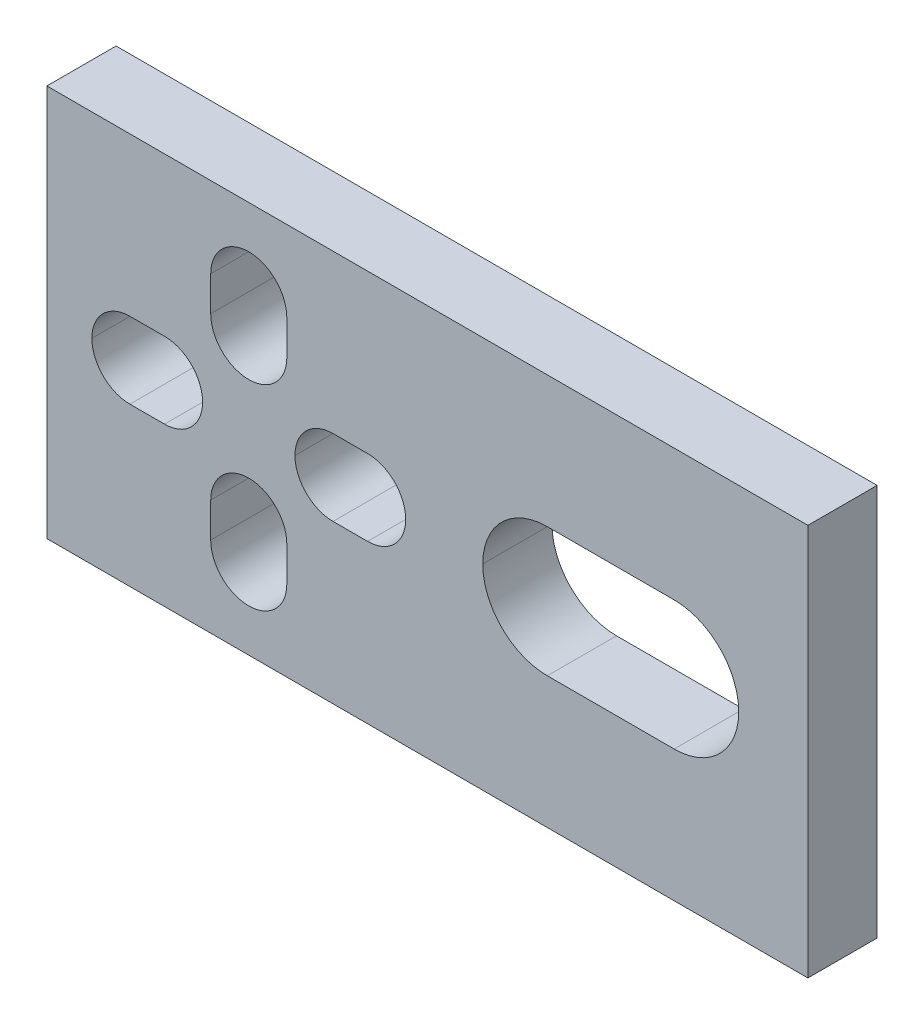
ISO-10303-21;
HEADER;
FILE_DESCRIPTION(('STEP AP214'),'2;1');
FILE_NAME('part.step','',(''),(''),'','','');
FILE_SCHEMA(('AUTOMOTIVE_DESIGN { 1 0 10303 214 1 1 1 1 }'));
ENDSEC;
DATA;
#1=APPLICATION_CONTEXT('core data for automotive mechanical design processes');
#2=APPLICATION_PROTOCOL_DEFINITION('international standard','automotive_design',2000,#1);
#3=PRODUCT_CONTEXT('',#1,'mechanical');
#4=PRODUCT('Part','Part','',(#3));
#5=PRODUCT_RELATED_PRODUCT_CATEGORY('part','',(#4));
#6=PRODUCT_DEFINITION_FORMATION('','',#4);
#7=PRODUCT_DEFINITION_CONTEXT('part definition',#1,'design');
#8=PRODUCT_DEFINITION('design','',#6,#7);
#9=PRODUCT_DEFINITION_SHAPE('','',#8);
#10=(LENGTH_UNIT() NAMED_UNIT(*) SI_UNIT(.MILLI.,.METRE.));
#11=(NAMED_UNIT(*) PLANE_ANGLE_UNIT() SI_UNIT($,.RADIAN.));
#12=(NAMED_UNIT(*) SI_UNIT($,.STERADIAN.) SOLID_ANGLE_UNIT());
#13=UNCERTAINTY_MEASURE_WITH_UNIT(LENGTH_MEASURE(1.E-05),#10,'distance_accuracy_value','');
#14=(GEOMETRIC_REPRESENTATION_CONTEXT(3) GLOBAL_UNCERTAINTY_ASSIGNED_CONTEXT((#13)) GLOBAL_UNIT_ASSIGNED_CONTEXT((#10,
#11,#12)) REPRESENTATION_CONTEXT('',''));
#15=CARTESIAN_POINT('',(0.,0.,0.));
#16=DIRECTION('',(0.,0.,1.));
#17=DIRECTION('',(1.,0.,0.));
#18=AXIS2_PLACEMENT_3D('',#15,#16,#17);
#19=CARTESIAN_POINT('',(-2.59330659401342,-1.65,3.));
#20=DIRECTION('',(0.,1.,0.));
#21=DIRECTION('',(1.,0.,0.));
#22=AXIS2_PLACEMENT_3D('',#19,#20,#21);
#23=PLANE('',#22);
#24=DIRECTION('',(-1.,0.,0.));
#25=VECTOR('',#24,1.);
#26=CARTESIAN_POINT('',(0.,-1.65,3.));
#27=LINE('',#26,#25);
#28=CARTESIAN_POINT('',(-2.59330659401342,-1.65,3.));
#29=VERTEX_POINT('',#28);
#30=CARTESIAN_POINT('',(-4.09330659401341,-1.65,3.));
#31=VERTEX_POINT('',#30);
#32=EDGE_CURVE('E11',#29,#31,#27,.T.);
#33=ORIENTED_EDGE('',*,*,#32,.F.);
#34=DIRECTION('',(0.,0.,-1.));
#35=VECTOR('',#34,1.);
#36=CARTESIAN_POINT('',(-2.59330659401342,-1.65,3.));
#37=LINE('',#36,#35);
#38=CARTESIAN_POINT('',(-2.59330659401342,-1.65,0.));
#39=VERTEX_POINT('',#38);
#40=EDGE_CURVE('E440',#29,#39,#37,.T.);
#41=ORIENTED_EDGE('',*,*,#40,.T.);
#42=DIRECTION('',(-1.,0.,0.));
#43=VECTOR('',#42,1.);
#44=CARTESIAN_POINT('',(-2.59330659401342,-1.65,0.));
#45=LINE('',#44,#43);
#46=CARTESIAN_POINT('',(-4.09330659401341,-1.65,0.));
#47=VERTEX_POINT('',#46);
#48=EDGE_CURVE('E347',#39,#47,#45,.T.);
#49=ORIENTED_EDGE('',*,*,#48,.T.);
#50=DIRECTION('',(0.,0.,1.));
#51=VECTOR('',#50,1.);
#52=CARTESIAN_POINT('',(-4.09330659401341,-1.65,3.));
#53=LINE('',#52,#51);
#54=EDGE_CURVE('E437',#47,#31,#53,.T.);
#55=ORIENTED_EDGE('',*,*,#54,.T.);
#56=EDGE_LOOP('',(#33,#41,#49,#55));
#57=FACE_BOUND('',#56,.T.);
#58=ADVANCED_FACE('F18',(#57),#23,.T.);
#59=CARTESIAN_POINT('',(-2.59330659401342,1.65,3.));
#60=DIRECTION('',(0.,-1.,0.));
#61=DIRECTION('',(0.,0.,-1.));
#62=AXIS2_PLACEMENT_3D('',#59,#60,#61);
#63=PLANE('',#62);
#64=DIRECTION('',(1.,0.,0.));
#65=VECTOR('',#64,1.);
#66=CARTESIAN_POINT('',(0.,1.65,3.));
#67=LINE('',#66,#65);
#68=CARTESIAN_POINT('',(-4.09330659401341,1.65,3.));
#69=VERTEX_POINT('',#68);
#70=CARTESIAN_POINT('',(-2.59330659401342,1.65,3.));
#71=VERTEX_POINT('',#70);
#72=EDGE_CURVE('E26',#69,#71,#67,.T.);
#73=ORIENTED_EDGE('',*,*,#72,.F.);
#74=DIRECTION('',(0.,0.,-1.));
#75=VECTOR('',#74,1.);
#76=CARTESIAN_POINT('',(-4.09330659401341,1.65,3.));
#77=LINE('',#76,#75);
#78=CARTESIAN_POINT('',(-4.09330659401341,1.65,0.));
#79=VERTEX_POINT('',#78);
#80=EDGE_CURVE('E822',#69,#79,#77,.T.);
#81=ORIENTED_EDGE('',*,*,#80,.T.);
#82=DIRECTION('',(1.,0.,0.));
#83=VECTOR('',#82,1.);
#84=CARTESIAN_POINT('',(-2.59330659401342,1.65,0.));
#85=LINE('',#84,#83);
#86=CARTESIAN_POINT('',(-2.59330659401342,1.65,0.));
#87=VERTEX_POINT('',#86);
#88=EDGE_CURVE('E361',#79,#87,#85,.T.);
#89=ORIENTED_EDGE('',*,*,#88,.T.);
#90=DIRECTION('',(0.,0.,1.));
#91=VECTOR('',#90,1.);
#92=CARTESIAN_POINT('',(-2.59330659401342,1.65,3.));
#93=LINE('',#92,#91);
#94=EDGE_CURVE('E446',#87,#71,#93,.T.);
#95=ORIENTED_EDGE('',*,*,#94,.T.);
#96=EDGE_LOOP('',(#73,#81,#89,#95));
#97=FACE_BOUND('',#96,.T.);
#98=ADVANCED_FACE('F1005',(#97),#63,.T.);
#99=CARTESIAN_POINT('',(-6.09665329700671,-3.5,3.));
#100=DIRECTION('',(-1.,0.,0.));
#101=DIRECTION('',(0.,0.,1.));
#102=AXIS2_PLACEMENT_3D('',#99,#100,#101);
#103=PLANE('',#102);
#104=DIRECTION('',(0.,-1.,0.));
#105=VECTOR('',#104,1.);
#106=CARTESIAN_POINT('',(-6.09665329700671,0.,3.));
#107=LINE('',#106,#105);
#108=CARTESIAN_POINT('',(-6.09665329700671,-3.5,3.));
#109=VERTEX_POINT('',#108);
#110=CARTESIAN_POINT('',(-6.09665329700671,-5.,3.));
#111=VERTEX_POINT('',#110);
#112=EDGE_CURVE('E249',#109,#111,#107,.T.);
#113=ORIENTED_EDGE('',*,*,#112,.F.);
#114=DIRECTION('',(0.,0.,-1.));
#115=VECTOR('',#114,1.);
#116=CARTESIAN_POINT('',(-6.09665329700671,-3.5,3.));
#117=LINE('',#116,#115);
#118=CARTESIAN_POINT('',(-6.09665329700671,-3.5,0.));
#119=VERTEX_POINT('',#118);
#120=EDGE_CURVE('E254',#109,#119,#117,.T.);
#121=ORIENTED_EDGE('',*,*,#120,.T.);
#122=DIRECTION('',(0.,-1.,0.));
#123=VECTOR('',#122,1.);
#124=CARTESIAN_POINT('',(-6.09665329700671,-3.5,0.));
#125=LINE('',#124,#123);
#126=CARTESIAN_POINT('',(-6.09665329700671,-5.,0.));
#127=VERTEX_POINT('',#126);
#128=EDGE_CURVE('E317',#119,#127,#125,.T.);
#129=ORIENTED_EDGE('',*,*,#128,.T.);
#130=DIRECTION('',(0.,0.,1.));
#131=VECTOR('',#130,1.);
#132=CARTESIAN_POINT('',(-6.09665329700671,-5.,3.));
#133=LINE('',#132,#131);
#134=EDGE_CURVE('E256',#127,#111,#133,.T.);
#135=ORIENTED_EDGE('',*,*,#134,.T.);
#136=EDGE_LOOP('',(#113,#121,#129,#135));
#137=FACE_BOUND('',#136,.T.);
#138=ADVANCED_FACE('F251',(#137),#103,.T.);
#139=CARTESIAN_POINT('',(-9.39665329700671,-5.,3.));
#140=DIRECTION('',(1.,0.,0.));
#141=DIRECTION('',(0.,1.,0.));
#142=AXIS2_PLACEMENT_3D('',#139,#140,#141);
#143=PLANE('',#142);
#144=DIRECTION('',(0.,1.,0.));
#145=VECTOR('',#144,1.);
#146=CARTESIAN_POINT('',(-9.39665329700671,0.,3.));
#147=LINE('',#146,#145);
#148=CARTESIAN_POINT('',(-9.39665329700671,-5.,3.));
#149=VERTEX_POINT('',#148);
#150=CARTESIAN_POINT('',(-9.39665329700671,-3.5,3.));
#151=VERTEX_POINT('',#150);
#152=EDGE_CURVE('E261',#149,#151,#147,.T.);
#153=ORIENTED_EDGE('',*,*,#152,.F.);
#154=DIRECTION('',(0.,0.,-1.));
#155=VECTOR('',#154,1.);
#156=CARTESIAN_POINT('',(-9.39665329700671,-5.,3.));
#157=LINE('',#156,#155);
#158=CARTESIAN_POINT('',(-9.39665329700671,-5.,0.));
#159=VERTEX_POINT('',#158);
#160=EDGE_CURVE('E365',#149,#159,#157,.T.);
#161=ORIENTED_EDGE('',*,*,#160,.T.);
#162=DIRECTION('',(0.,1.,0.));
#163=VECTOR('',#162,1.);
#164=CARTESIAN_POINT('',(-9.39665329700671,-5.,0.));
#165=LINE('',#164,#163);
#166=CARTESIAN_POINT('',(-9.39665329700671,-3.5,0.));
#167=VERTEX_POINT('',#166);
#168=EDGE_CURVE('E339',#159,#167,#165,.T.);
#169=ORIENTED_EDGE('',*,*,#168,.T.);
#170=DIRECTION('',(0.,0.,1.));
#171=VECTOR('',#170,1.);
#172=CARTESIAN_POINT('',(-9.39665329700671,-3.5,3.));
#173=LINE('',#172,#171);
#174=EDGE_CURVE('E269',#167,#151,#173,.T.);
#175=ORIENTED_EDGE('',*,*,#174,.T.);
#176=EDGE_LOOP('',(#153,#161,#169,#175));
#177=FACE_BOUND('',#176,.T.);
#178=ADVANCED_FACE('F1015',(#177),#143,.T.);
#179=CARTESIAN_POINT('',(-12.9,-1.65,3.));
#180=DIRECTION('',(0.,1.,0.));
#181=DIRECTION('',(1.,0.,0.));
#182=AXIS2_PLACEMENT_3D('',#179,#180,#181);
#183=PLANE('',#182);
#184=DIRECTION('',(-1.,0.,0.));
#185=VECTOR('',#184,1.);
#186=CARTESIAN_POINT('',(0.,-1.65,3.));
#187=LINE('',#186,#185);
#188=CARTESIAN_POINT('',(-11.4,-1.65,3.));
#189=VERTEX_POINT('',#188);
#190=CARTESIAN_POINT('',(-12.9,-1.65,3.));
#191=VERTEX_POINT('',#190);
#192=EDGE_CURVE('E451',#189,#191,#187,.T.);
#193=ORIENTED_EDGE('',*,*,#192,.F.);
#194=DIRECTION('',(0.,0.,-1.));
#195=VECTOR('',#194,1.);
#196=CARTESIAN_POINT('',(-11.4,-1.65,3.));
#197=LINE('',#196,#195);
#198=CARTESIAN_POINT('',(-11.4,-1.65,0.));
#199=VERTEX_POINT('',#198);
#200=EDGE_CURVE('E407',#189,#199,#197,.T.);
#201=ORIENTED_EDGE('',*,*,#200,.T.);
#202=DIRECTION('',(-1.,0.,0.));
#203=VECTOR('',#202,1.);
#204=CARTESIAN_POINT('',(-12.9,-1.65,0.));
#205=LINE('',#204,#203);
#206=CARTESIAN_POINT('',(-12.9,-1.65,0.));
#207=VERTEX_POINT('',#206);
#208=EDGE_CURVE('E316',#199,#207,#205,.T.);
#209=ORIENTED_EDGE('',*,*,#208,.T.);
#210=DIRECTION('',(0.,0.,1.));
#211=VECTOR('',#210,1.);
#212=CARTESIAN_POINT('',(-12.9,-1.65,3.));
#213=LINE('',#212,#211);
#214=EDGE_CURVE('E406',#207,#191,#213,.T.);
#215=ORIENTED_EDGE('',*,*,#214,.T.);
#216=EDGE_LOOP('',(#193,#201,#209,#215));
#217=FACE_BOUND('',#216,.T.);
#218=ADVANCED_FACE('F1020',(#217),#183,.T.);
#219=CARTESIAN_POINT('',(-12.9,1.65,3.));
#220=DIRECTION('',(0.,-1.,0.));
#221=DIRECTION('',(0.,0.,-1.));
#222=AXIS2_PLACEMENT_3D('',#219,#220,#221);
#223=PLANE('',#222);
#224=DIRECTION('',(1.,0.,0.));
#225=VECTOR('',#224,1.);
#226=CARTESIAN_POINT('',(0.,1.65,3.));
#227=LINE('',#226,#225);
#228=CARTESIAN_POINT('',(-12.9,1.65,3.));
#229=VERTEX_POINT('',#228);
#230=CARTESIAN_POINT('',(-11.4,1.65,3.));
#231=VERTEX_POINT('',#230);
#232=EDGE_CURVE('E454',#229,#231,#227,.T.);
#233=ORIENTED_EDGE('',*,*,#232,.F.);
#234=DIRECTION('',(0.,0.,-1.));
#235=VECTOR('',#234,1.);
#236=CARTESIAN_POINT('',(-12.9,1.65,3.));
#237=LINE('',#236,#235);
#238=CARTESIAN_POINT('',(-12.9,1.65,0.));
#239=VERTEX_POINT('',#238);
#240=EDGE_CURVE('E813',#229,#239,#237,.T.);
#241=ORIENTED_EDGE('',*,*,#240,.T.);
#242=DIRECTION('',(1.,0.,0.));
#243=VECTOR('',#242,1.);
#244=CARTESIAN_POINT('',(-12.9,1.65,0.));
#245=LINE('',#244,#243);
#246=CARTESIAN_POINT('',(-11.4,1.65,0.));
#247=VERTEX_POINT('',#246);
#248=EDGE_CURVE('E320',#239,#247,#245,.T.);
#249=ORIENTED_EDGE('',*,*,#248,.T.);
#250=DIRECTION('',(0.,0.,1.));
#251=VECTOR('',#250,1.);
#252=CARTESIAN_POINT('',(-11.4,1.65,3.));
#253=LINE('',#252,#251);
#254=EDGE_CURVE('E348',#247,#231,#253,.T.);
#255=ORIENTED_EDGE('',*,*,#254,.T.);
#256=EDGE_LOOP('',(#233,#241,#249,#255));
#257=FACE_BOUND('',#256,.T.);
#258=ADVANCED_FACE('F1022',(#257),#223,.T.);
#259=CARTESIAN_POINT('',(-6.09665329700671,3.5,3.));
#260=DIRECTION('',(-1.,0.,0.));
#261=DIRECTION('',(0.,0.,1.));
#262=AXIS2_PLACEMENT_3D('',#259,#260,#261);
#263=PLANE('',#262);
#264=DIRECTION('',(0.,-1.,0.));
#265=VECTOR('',#264,1.);
#266=CARTESIAN_POINT('',(-6.09665329700671,0.,3.));
#267=LINE('',#266,#265);
#268=CARTESIAN_POINT('',(-6.09665329700671,5.,3.));
#269=VERTEX_POINT('',#268);
#270=CARTESIAN_POINT('',(-6.09665329700671,3.5,3.));
#271=VERTEX_POINT('',#270);
#272=EDGE_CURVE('E450',#269,#271,#267,.T.);
#273=ORIENTED_EDGE('',*,*,#272,.F.);
#274=DIRECTION('',(0.,0.,-1.));
#275=VECTOR('',#274,1.);
#276=CARTESIAN_POINT('',(-6.09665329700671,5.,3.));
#277=LINE('',#276,#275);
#278=CARTESIAN_POINT('',(-6.09665329700671,5.,0.));
#279=VERTEX_POINT('',#278);
#280=EDGE_CURVE('E398',#269,#279,#277,.T.);
#281=ORIENTED_EDGE('',*,*,#280,.T.);
#282=DIRECTION('',(0.,-1.,0.));
#283=VECTOR('',#282,1.);
#284=CARTESIAN_POINT('',(-6.09665329700671,3.5,0.));
#285=LINE('',#284,#283);
#286=CARTESIAN_POINT('',(-6.09665329700671,3.5,0.));
#287=VERTEX_POINT('',#286);
#288=EDGE_CURVE('E291',#279,#287,#285,.T.);
#289=ORIENTED_EDGE('',*,*,#288,.T.);
#290=DIRECTION('',(0.,0.,1.));
#291=VECTOR('',#290,1.);
#292=CARTESIAN_POINT('',(-6.09665329700671,3.5,3.));
#293=LINE('',#292,#291);
#294=EDGE_CURVE('E397',#287,#271,#293,.T.);
#295=ORIENTED_EDGE('',*,*,#294,.T.);
#296=EDGE_LOOP('',(#273,#281,#289,#295));
#297=FACE_BOUND('',#296,.T.);
#298=ADVANCED_FACE('F1025',(#297),#263,.T.);
#299=CARTESIAN_POINT('',(-9.39665329700671,5.,3.));
#300=DIRECTION('',(1.,0.,0.));
#301=DIRECTION('',(0.,1.,0.));
#302=AXIS2_PLACEMENT_3D('',#299,#300,#301);
#303=PLANE('',#302);
#304=DIRECTION('',(0.,1.,0.));
#305=VECTOR('',#304,1.);
#306=CARTESIAN_POINT('',(-9.39665329700671,0.,3.));
#307=LINE('',#306,#305);
#308=CARTESIAN_POINT('',(-9.39665329700671,3.5,3.));
#309=VERTEX_POINT('',#308);
#310=CARTESIAN_POINT('',(-9.39665329700671,5.,3.));
#311=VERTEX_POINT('',#310);
#312=EDGE_CURVE('E447',#309,#311,#307,.T.);
#313=ORIENTED_EDGE('',*,*,#312,.F.);
#314=DIRECTION('',(0.,0.,-1.));
#315=VECTOR('',#314,1.);
#316=CARTESIAN_POINT('',(-9.39665329700671,3.5,3.));
#317=LINE('',#316,#315);
#318=CARTESIAN_POINT('',(-9.39665329700671,3.5,0.));
#319=VERTEX_POINT('',#318);
#320=EDGE_CURVE('E390',#309,#319,#317,.T.);
#321=ORIENTED_EDGE('',*,*,#320,.T.);
#322=DIRECTION('',(0.,1.,0.));
#323=VECTOR('',#322,1.);
#324=CARTESIAN_POINT('',(-9.39665329700671,5.,0.));
#325=LINE('',#324,#323);
#326=CARTESIAN_POINT('',(-9.39665329700671,5.,0.));
#327=VERTEX_POINT('',#326);
#328=EDGE_CURVE('E299',#319,#327,#325,.T.);
#329=ORIENTED_EDGE('',*,*,#328,.T.);
#330=DIRECTION('',(0.,0.,1.));
#331=VECTOR('',#330,1.);
#332=CARTESIAN_POINT('',(-9.39665329700671,5.,3.));
#333=LINE('',#332,#331);
#334=EDGE_CURVE('E300',#327,#311,#333,.T.);
#335=ORIENTED_EDGE('',*,*,#334,.T.);
#336=EDGE_LOOP('',(#313,#321,#329,#335));
#337=FACE_BOUND('',#336,.T.);
#338=ADVANCED_FACE('F1027',(#337),#303,.T.);
#339=CARTESIAN_POINT('',(0.,0.,3.));
#340=DIRECTION('',(0.,0.,1.));
#341=DIRECTION('',(1.,0.,0.));
#342=AXIS2_PLACEMENT_3D('',#339,#340,#341);
#343=PLANE('',#342);
#344=ORIENTED_EDGE('',*,*,#72,.T.);
#345=CARTESIAN_POINT('',(-2.59330659401342,0.,3.));
#346=DIRECTION('',(0.,0.,-1.));
#347=DIRECTION('',(-1.,0.,0.));
#348=AXIS2_PLACEMENT_3D('',#345,#346,#347);
#349=CIRCLE('',#348,1.65);
#350=EDGE_CURVE('E443',#71,#29,#349,.T.);
#351=ORIENTED_EDGE('',*,*,#350,.T.);
#352=ORIENTED_EDGE('',*,*,#32,.T.);
#353=CARTESIAN_POINT('',(-4.09330659401341,0.,3.));
#354=DIRECTION('',(0.,0.,-1.));
#355=DIRECTION('',(-1.,0.,0.));
#356=AXIS2_PLACEMENT_3D('',#353,#354,#355);
#357=CIRCLE('',#356,1.65);
#358=CARTESIAN_POINT('',(-5.74330659401342,0.,3.));
#359=VERTEX_POINT('',#358);
#360=EDGE_CURVE('E434',#31,#359,#357,.T.);
#361=ORIENTED_EDGE('',*,*,#360,.T.);
#362=CARTESIAN_POINT('',(-4.09330659401341,0.,3.));
#363=DIRECTION('',(0.,0.,-1.));
#364=DIRECTION('',(-1.,0.,0.));
#365=AXIS2_PLACEMENT_3D('',#362,#363,#364);
#366=CIRCLE('',#365,1.65);
#367=EDGE_CURVE('E804',#359,#69,#366,.T.);
#368=ORIENTED_EDGE('',*,*,#367,.T.);
#369=EDGE_LOOP('',(#344,#351,#352,#361,#368));
#370=FACE_BOUND('',#369,.T.);
#371=ORIENTED_EDGE('',*,*,#152,.T.);
#372=CARTESIAN_POINT('',(-7.74665329700671,-3.5,3.));
#373=DIRECTION('',(0.,0.,-1.));
#374=DIRECTION('',(-1.,0.,0.));
#375=AXIS2_PLACEMENT_3D('',#372,#373,#374);
#376=CIRCLE('',#375,1.65);
#377=EDGE_CURVE('E263',#151,#109,#376,.T.);
#378=ORIENTED_EDGE('',*,*,#377,.T.);
#379=ORIENTED_EDGE('',*,*,#112,.T.);
#380=CARTESIAN_POINT('',(-7.74665329700671,-5.,3.));
#381=DIRECTION('',(0.,0.,-1.));
#382=DIRECTION('',(-1.,0.,0.));
#383=AXIS2_PLACEMENT_3D('',#380,#381,#382);
#384=CIRCLE('',#383,1.65);
#385=EDGE_CURVE('E281',#111,#149,#384,.T.);
#386=ORIENTED_EDGE('',*,*,#385,.T.);
#387=EDGE_LOOP('',(#371,#378,#379,#386));
#388=FACE_BOUND('',#387,.T.);
#389=ORIENTED_EDGE('',*,*,#232,.T.);
#390=CARTESIAN_POINT('',(-11.4,0.,3.));
#391=DIRECTION('',(0.,0.,-1.));
#392=DIRECTION('',(-1.,0.,0.));
#393=AXIS2_PLACEMENT_3D('',#390,#391,#392);
#394=CIRCLE('',#393,1.65);
#395=EDGE_CURVE('E353',#231,#189,#394,.T.);
#396=ORIENTED_EDGE('',*,*,#395,.T.);
#397=ORIENTED_EDGE('',*,*,#192,.T.);
#398=CARTESIAN_POINT('',(-12.9,0.,3.));
#399=DIRECTION('',(0.,0.,-1.));
#400=DIRECTION('',(-1.,0.,0.));
#401=AXIS2_PLACEMENT_3D('',#398,#399,#400);
#402=CIRCLE('',#401,1.65);
#403=CARTESIAN_POINT('',(-14.55,0.,3.));
#404=VERTEX_POINT('',#403);
#405=EDGE_CURVE('E304',#191,#404,#402,.T.);
#406=ORIENTED_EDGE('',*,*,#405,.T.);
#407=CARTESIAN_POINT('',(-12.9,0.,3.));
#408=DIRECTION('',(0.,0.,-1.));
#409=DIRECTION('',(-1.,0.,0.));
#410=AXIS2_PLACEMENT_3D('',#407,#408,#409);
#411=CIRCLE('',#410,1.65);
#412=EDGE_CURVE('E858',#404,#229,#411,.T.);
#413=ORIENTED_EDGE('',*,*,#412,.T.);
#414=EDGE_LOOP('',(#389,#396,#397,#406,#413));
#415=FACE_BOUND('',#414,.T.);
#416=ORIENTED_EDGE('',*,*,#312,.T.);
#417=CARTESIAN_POINT('',(-7.74665329700671,5.,3.));
#418=DIRECTION('',(0.,0.,-1.));
#419=DIRECTION('',(-1.,0.,0.));
#420=AXIS2_PLACEMENT_3D('',#417,#418,#419);
#421=CIRCLE('',#420,1.65);
#422=EDGE_CURVE('E305',#311,#269,#421,.T.);
#423=ORIENTED_EDGE('',*,*,#422,.T.);
#424=ORIENTED_EDGE('',*,*,#272,.T.);
#425=CARTESIAN_POINT('',(-7.74665329700671,3.5,3.));
#426=DIRECTION('',(0.,0.,-1.));
#427=DIRECTION('',(-1.,0.,0.));
#428=AXIS2_PLACEMENT_3D('',#425,#426,#427);
#429=CIRCLE('',#428,1.65);
#430=EDGE_CURVE('E393',#271,#309,#429,.T.);
#431=ORIENTED_EDGE('',*,*,#430,.T.);
#432=EDGE_LOOP('',(#416,#423,#424,#431));
#433=FACE_BOUND('',#432,.T.);
#434=DIRECTION('',(-1.,0.,0.));
#435=VECTOR('',#434,1.);
#436=CARTESIAN_POINT('',(5.2,2.8,3.));
#437=LINE('',#436,#435);
#438=CARTESIAN_POINT('',(10.7,2.8,3.));
#439=VERTEX_POINT('',#438);
#440=CARTESIAN_POINT('',(5.2,2.8,3.));
#441=VERTEX_POINT('',#440);
#442=EDGE_CURVE('E332',#439,#441,#437,.T.);
#443=ORIENTED_EDGE('',*,*,#442,.F.);
#444=CARTESIAN_POINT('',(10.7,0.,3.));
#445=DIRECTION('',(0.,0.,-1.));
#446=DIRECTION('',(-1.,0.,0.));
#447=AXIS2_PLACEMENT_3D('',#444,#445,#446);
#448=CIRCLE('',#447,2.8);
#449=CARTESIAN_POINT('',(10.7,-2.8,3.));
#450=VERTEX_POINT('',#449);
#451=EDGE_CURVE('E333',#439,#450,#448,.T.);
#452=ORIENTED_EDGE('',*,*,#451,.T.);
#453=DIRECTION('',(1.,0.,0.));
#454=VECTOR('',#453,1.);
#455=CARTESIAN_POINT('',(5.2,-2.8,3.));
#456=LINE('',#455,#454);
#457=CARTESIAN_POINT('',(5.2,-2.8,3.));
#458=VERTEX_POINT('',#457);
#459=EDGE_CURVE('E379',#458,#450,#456,.T.);
#460=ORIENTED_EDGE('',*,*,#459,.F.);
#461=CARTESIAN_POINT('',(5.2,0.,3.));
#462=DIRECTION('',(0.,0.,-1.));
#463=DIRECTION('',(-1.,0.,0.));
#464=AXIS2_PLACEMENT_3D('',#461,#462,#463);
#465=CIRCLE('',#464,2.8);
#466=CARTESIAN_POINT('',(2.4,0.,3.));
#467=VERTEX_POINT('',#466);
#468=EDGE_CURVE('E374',#458,#467,#465,.T.);
#469=ORIENTED_EDGE('',*,*,#468,.T.);
#470=CARTESIAN_POINT('',(5.2,0.,3.));
#471=DIRECTION('',(0.,0.,-1.));
#472=DIRECTION('',(-1.,0.,0.));
#473=AXIS2_PLACEMENT_3D('',#470,#471,#472);
#474=CIRCLE('',#473,2.8);
#475=EDGE_CURVE('E888',#467,#441,#474,.T.);
#476=ORIENTED_EDGE('',*,*,#475,.T.);
#477=EDGE_LOOP('',(#443,#452,#460,#469,#476));
#478=FACE_BOUND('',#477,.T.);
#479=DIRECTION('',(0.,-1.,0.));
#480=VECTOR('',#479,1.);
#481=CARTESIAN_POINT('',(-16.5,8.5,3.));
#482=LINE('',#481,#480);
#483=CARTESIAN_POINT('',(-16.5,8.5,3.));
#484=VERTEX_POINT('',#483);
#485=CARTESIAN_POINT('',(-16.5,-8.5,3.));
#486=VERTEX_POINT('',#485);
#487=EDGE_CURVE('E427',#484,#486,#482,.T.);
#488=ORIENTED_EDGE('',*,*,#487,.T.);
#489=DIRECTION('',(1.,0.,0.));
#490=VECTOR('',#489,1.);
#491=CARTESIAN_POINT('',(-16.5,-8.5,3.));
#492=LINE('',#491,#490);
#493=CARTESIAN_POINT('',(16.5,-8.5,3.));
#494=VERTEX_POINT('',#493);
#495=EDGE_CURVE('E420',#486,#494,#492,.T.);
#496=ORIENTED_EDGE('',*,*,#495,.T.);
#497=DIRECTION('',(0.,1.,0.));
#498=VECTOR('',#497,1.);
#499=CARTESIAN_POINT('',(16.5,8.5,3.));
#500=LINE('',#499,#498);
#501=CARTESIAN_POINT('',(16.5,8.5,3.));
#502=VERTEX_POINT('',#501);
#503=EDGE_CURVE('E370',#494,#502,#500,.T.);
#504=ORIENTED_EDGE('',*,*,#503,.T.);
#505=DIRECTION('',(-1.,0.,0.));
#506=VECTOR('',#505,1.);
#507=CARTESIAN_POINT('',(-16.5,8.5,3.));
#508=LINE('',#507,#506);
#509=EDGE_CURVE('E362',#502,#484,#508,.T.);
#510=ORIENTED_EDGE('',*,*,#509,.T.);
#511=EDGE_LOOP('',(#488,#496,#504,#510));
#512=FACE_BOUND('',#511,.T.);
#513=ADVANCED_FACE('F264',(#370,#388,#415,#433,#478,#512),#343,.T.);
#514=CARTESIAN_POINT('',(-2.59330659401342,0.,3.));
#515=DIRECTION('',(0.,0.,-1.));
#516=DIRECTION('',(-1.,0.,0.));
#517=AXIS2_PLACEMENT_3D('',#514,#515,#516);
#518=CYLINDRICAL_SURFACE('',#517,1.65);
#519=ORIENTED_EDGE('',*,*,#40,.F.);
#520=ORIENTED_EDGE('',*,*,#350,.F.);
#521=ORIENTED_EDGE('',*,*,#94,.F.);
#522=CARTESIAN_POINT('',(-2.59330659401342,0.,0.));
#523=DIRECTION('',(0.,0.,-1.));
#524=DIRECTION('',(-1.,0.,0.));
#525=AXIS2_PLACEMENT_3D('',#522,#523,#524);
#526=CIRCLE('',#525,1.65);
#527=EDGE_CURVE('E357',#87,#39,#526,.T.);
#528=ORIENTED_EDGE('',*,*,#527,.T.);
#529=EDGE_LOOP('',(#519,#520,#521,#528));
#530=FACE_BOUND('',#529,.T.);
#531=ADVANCED_FACE('F1033',(#530),#518,.F.);
#532=CARTESIAN_POINT('',(-4.09330659401341,0.,3.));
#533=DIRECTION('',(0.,0.,-1.));
#534=DIRECTION('',(-1.,0.,0.));
#535=AXIS2_PLACEMENT_3D('',#532,#533,#534);
#536=CYLINDRICAL_SURFACE('',#535,1.65);
#537=DIRECTION('',(0.,0.,-1.));
#538=VECTOR('',#537,1.);
#539=CARTESIAN_POINT('',(-5.74330659401342,0.,3.));
#540=LINE('',#539,#538);
#541=CARTESIAN_POINT('',(-5.74330659401342,0.,0.));
#542=VERTEX_POINT('',#541);
#543=EDGE_CURVE('E798',#359,#542,#540,.T.);
#544=ORIENTED_EDGE('',*,*,#543,.F.);
#545=ORIENTED_EDGE('',*,*,#360,.F.);
#546=ORIENTED_EDGE('',*,*,#54,.F.);
#547=CARTESIAN_POINT('',(-4.09330659401341,0.,0.));
#548=DIRECTION('',(0.,0.,-1.));
#549=DIRECTION('',(-1.,0.,0.));
#550=AXIS2_PLACEMENT_3D('',#547,#548,#549);
#551=CIRCLE('',#550,1.65);
#552=EDGE_CURVE('E344',#47,#542,#551,.T.);
#553=ORIENTED_EDGE('',*,*,#552,.T.);
#554=EDGE_LOOP('',(#544,#545,#546,#553));
#555=FACE_BOUND('',#554,.T.);
#556=ADVANCED_FACE('F1036',(#555),#536,.F.);
#557=CARTESIAN_POINT('',(-7.74665329700671,-3.5,3.));
#558=DIRECTION('',(0.,0.,-1.));
#559=DIRECTION('',(-1.,0.,0.));
#560=AXIS2_PLACEMENT_3D('',#557,#558,#559);
#561=CYLINDRICAL_SURFACE('',#560,1.65);
#562=ORIENTED_EDGE('',*,*,#120,.F.);
#563=ORIENTED_EDGE('',*,*,#377,.F.);
#564=ORIENTED_EDGE('',*,*,#174,.F.);
#565=CARTESIAN_POINT('',(-7.74665329700671,-3.5,0.));
#566=DIRECTION('',(0.,0.,-1.));
#567=DIRECTION('',(-1.,0.,0.));
#568=AXIS2_PLACEMENT_3D('',#565,#566,#567);
#569=CIRCLE('',#568,1.65);
#570=EDGE_CURVE('E273',#167,#119,#569,.T.);
#571=ORIENTED_EDGE('',*,*,#570,.T.);
#572=EDGE_LOOP('',(#562,#563,#564,#571));
#573=FACE_BOUND('',#572,.T.);
#574=ADVANCED_FACE('F271',(#573),#561,.F.);
#575=CARTESIAN_POINT('',(-7.74665329700671,-5.,3.));
#576=DIRECTION('',(0.,0.,-1.));
#577=DIRECTION('',(-1.,0.,0.));
#578=AXIS2_PLACEMENT_3D('',#575,#576,#577);
#579=CYLINDRICAL_SURFACE('',#578,1.65);
#580=ORIENTED_EDGE('',*,*,#160,.F.);
#581=ORIENTED_EDGE('',*,*,#385,.F.);
#582=ORIENTED_EDGE('',*,*,#134,.F.);
#583=CARTESIAN_POINT('',(-7.74665329700671,-5.,0.));
#584=DIRECTION('',(0.,0.,-1.));
#585=DIRECTION('',(-1.,0.,0.));
#586=AXIS2_PLACEMENT_3D('',#583,#584,#585);
#587=CIRCLE('',#586,1.65);
#588=EDGE_CURVE('E343',#127,#159,#587,.T.);
#589=ORIENTED_EDGE('',*,*,#588,.T.);
#590=EDGE_LOOP('',(#580,#581,#582,#589));
#591=FACE_BOUND('',#590,.T.);
#592=ADVANCED_FACE('F1046',(#591),#579,.F.);
#593=CARTESIAN_POINT('',(-16.5,8.5,3.));
#594=DIRECTION('',(0.,-1.,0.));
#595=DIRECTION('',(0.,0.,-1.));
#596=AXIS2_PLACEMENT_3D('',#593,#594,#595);
#597=PLANE('',#596);
#598=DIRECTION('',(0.,0.,1.));
#599=VECTOR('',#598,1.);
#600=CARTESIAN_POINT('',(-16.5,8.5,3.));
#601=LINE('',#600,#599);
#602=CARTESIAN_POINT('',(-16.5,8.5,0.));
#603=VERTEX_POINT('',#602);
#604=EDGE_CURVE('E366',#603,#484,#601,.T.);
#605=ORIENTED_EDGE('',*,*,#604,.T.);
#606=ORIENTED_EDGE('',*,*,#509,.F.);
#607=DIRECTION('',(0.,0.,-1.));
#608=VECTOR('',#607,1.);
#609=CARTESIAN_POINT('',(16.5,8.5,3.));
#610=LINE('',#609,#608);
#611=CARTESIAN_POINT('',(16.5,8.5,0.));
#612=VERTEX_POINT('',#611);
#613=EDGE_CURVE('E352',#502,#612,#610,.T.);
#614=ORIENTED_EDGE('',*,*,#613,.T.);
#615=DIRECTION('',(-1.,0.,0.));
#616=VECTOR('',#615,1.);
#617=CARTESIAN_POINT('',(0.,8.5,0.));
#618=LINE('',#617,#616);
#619=EDGE_CURVE('E790',#612,#603,#618,.T.);
#620=ORIENTED_EDGE('',*,*,#619,.T.);
#621=EDGE_LOOP('',(#605,#606,#614,#620));
#622=FACE_BOUND('',#621,.T.);
#623=ADVANCED_FACE('F987',(#622),#597,.F.);
#624=CARTESIAN_POINT('',(-16.5,8.5,3.));
#625=DIRECTION('',(1.,0.,0.));
#626=DIRECTION('',(0.,1.,0.));
#627=AXIS2_PLACEMENT_3D('',#624,#625,#626);
#628=PLANE('',#627);
#629=DIRECTION('',(0.,0.,1.));
#630=VECTOR('',#629,1.);
#631=CARTESIAN_POINT('',(-16.5,-8.5,3.));
#632=LINE('',#631,#630);
#633=CARTESIAN_POINT('',(-16.5,-8.5,0.));
#634=VERTEX_POINT('',#633);
#635=EDGE_CURVE('E423',#634,#486,#632,.T.);
#636=ORIENTED_EDGE('',*,*,#635,.T.);
#637=ORIENTED_EDGE('',*,*,#487,.F.);
#638=ORIENTED_EDGE('',*,*,#604,.F.);
#639=DIRECTION('',(0.,-1.,0.));
#640=VECTOR('',#639,1.);
#641=CARTESIAN_POINT('',(-16.5,0.,0.));
#642=LINE('',#641,#640);
#643=EDGE_CURVE('E785',#603,#634,#642,.T.);
#644=ORIENTED_EDGE('',*,*,#643,.T.);
#645=EDGE_LOOP('',(#636,#637,#638,#644));
#646=FACE_BOUND('',#645,.T.);
#647=ADVANCED_FACE('F1000',(#646),#628,.F.);
#648=CARTESIAN_POINT('',(-16.5,-8.5,3.));
#649=DIRECTION('',(0.,1.,0.));
#650=DIRECTION('',(1.,0.,0.));
#651=AXIS2_PLACEMENT_3D('',#648,#649,#650);
#652=PLANE('',#651);
#653=DIRECTION('',(0.,0.,1.));
#654=VECTOR('',#653,1.);
#655=CARTESIAN_POINT('',(16.5,-8.5,3.));
#656=LINE('',#655,#654);
#657=CARTESIAN_POINT('',(16.5,-8.5,0.));
#658=VERTEX_POINT('',#657);
#659=EDGE_CURVE('E416',#658,#494,#656,.T.);
#660=ORIENTED_EDGE('',*,*,#659,.T.);
#661=ORIENTED_EDGE('',*,*,#495,.F.);
#662=ORIENTED_EDGE('',*,*,#635,.F.);
#663=DIRECTION('',(1.,0.,0.));
#664=VECTOR('',#663,1.);
#665=CARTESIAN_POINT('',(0.,-8.5,0.));
#666=LINE('',#665,#664);
#667=EDGE_CURVE('E791',#634,#658,#666,.T.);
#668=ORIENTED_EDGE('',*,*,#667,.T.);
#669=EDGE_LOOP('',(#660,#661,#662,#668));
#670=FACE_BOUND('',#669,.T.);
#671=ADVANCED_FACE('F972',(#670),#652,.F.);
#672=CARTESIAN_POINT('',(16.5,8.5,3.));
#673=DIRECTION('',(-1.,0.,0.));
#674=DIRECTION('',(0.,0.,1.));
#675=AXIS2_PLACEMENT_3D('',#672,#673,#674);
#676=PLANE('',#675);
#677=ORIENTED_EDGE('',*,*,#613,.F.);
#678=ORIENTED_EDGE('',*,*,#503,.F.);
#679=ORIENTED_EDGE('',*,*,#659,.F.);
#680=DIRECTION('',(0.,1.,0.));
#681=VECTOR('',#680,1.);
#682=CARTESIAN_POINT('',(16.5,0.,0.));
#683=LINE('',#682,#681);
#684=EDGE_CURVE('E765',#658,#612,#683,.T.);
#685=ORIENTED_EDGE('',*,*,#684,.T.);
#686=EDGE_LOOP('',(#677,#678,#679,#685));
#687=FACE_BOUND('',#686,.T.);
#688=ADVANCED_FACE('F988',(#687),#676,.F.);
#689=CARTESIAN_POINT('',(-11.4,0.,3.));
#690=DIRECTION('',(0.,0.,-1.));
#691=DIRECTION('',(-1.,0.,0.));
#692=AXIS2_PLACEMENT_3D('',#689,#690,#691);
#693=CYLINDRICAL_SURFACE('',#692,1.65);
#694=ORIENTED_EDGE('',*,*,#200,.F.);
#695=ORIENTED_EDGE('',*,*,#395,.F.);
#696=ORIENTED_EDGE('',*,*,#254,.F.);
#697=CARTESIAN_POINT('',(-11.4,0.,0.));
#698=DIRECTION('',(0.,0.,-1.));
#699=DIRECTION('',(-1.,0.,0.));
#700=AXIS2_PLACEMENT_3D('',#697,#698,#699);
#701=CIRCLE('',#700,1.65);
#702=EDGE_CURVE('E324',#247,#199,#701,.T.);
#703=ORIENTED_EDGE('',*,*,#702,.T.);
#704=EDGE_LOOP('',(#694,#695,#696,#703));
#705=FACE_BOUND('',#704,.T.);
#706=ADVANCED_FACE('F990',(#705),#693,.F.);
#707=CARTESIAN_POINT('',(-12.9,0.,3.));
#708=DIRECTION('',(0.,0.,-1.));
#709=DIRECTION('',(-1.,0.,0.));
#710=AXIS2_PLACEMENT_3D('',#707,#708,#709);
#711=CYLINDRICAL_SURFACE('',#710,1.65);
#712=DIRECTION('',(0.,0.,-1.));
#713=VECTOR('',#712,1.);
#714=CARTESIAN_POINT('',(-14.55,0.,3.));
#715=LINE('',#714,#713);
#716=CARTESIAN_POINT('',(-14.55,0.,0.));
#717=VERTEX_POINT('',#716);
#718=EDGE_CURVE('E839',#404,#717,#715,.T.);
#719=ORIENTED_EDGE('',*,*,#718,.F.);
#720=ORIENTED_EDGE('',*,*,#405,.F.);
#721=ORIENTED_EDGE('',*,*,#214,.F.);
#722=CARTESIAN_POINT('',(-12.9,0.,0.));
#723=DIRECTION('',(0.,0.,-1.));
#724=DIRECTION('',(-1.,0.,0.));
#725=AXIS2_PLACEMENT_3D('',#722,#723,#724);
#726=CIRCLE('',#725,1.65);
#727=EDGE_CURVE('E313',#207,#717,#726,.T.);
#728=ORIENTED_EDGE('',*,*,#727,.T.);
#729=EDGE_LOOP('',(#719,#720,#721,#728));
#730=FACE_BOUND('',#729,.T.);
#731=ADVANCED_FACE('F997',(#730),#711,.F.);
#732=CARTESIAN_POINT('',(-7.74665329700671,5.,3.));
#733=DIRECTION('',(0.,0.,-1.));
#734=DIRECTION('',(-1.,0.,0.));
#735=AXIS2_PLACEMENT_3D('',#732,#733,#734);
#736=CYLINDRICAL_SURFACE('',#735,1.65);
#737=ORIENTED_EDGE('',*,*,#280,.F.);
#738=ORIENTED_EDGE('',*,*,#422,.F.);
#739=ORIENTED_EDGE('',*,*,#334,.F.);
#740=CARTESIAN_POINT('',(-7.74665329700671,5.,0.));
#741=DIRECTION('',(0.,0.,-1.));
#742=DIRECTION('',(-1.,0.,0.));
#743=AXIS2_PLACEMENT_3D('',#740,#741,#742);
#744=CIRCLE('',#743,1.65);
#745=EDGE_CURVE('E295',#327,#279,#744,.T.);
#746=ORIENTED_EDGE('',*,*,#745,.T.);
#747=EDGE_LOOP('',(#737,#738,#739,#746));
#748=FACE_BOUND('',#747,.T.);
#749=ADVANCED_FACE('F1066',(#748),#736,.F.);
#750=CARTESIAN_POINT('',(-7.74665329700671,3.5,3.));
#751=DIRECTION('',(0.,0.,-1.));
#752=DIRECTION('',(-1.,0.,0.));
#753=AXIS2_PLACEMENT_3D('',#750,#751,#752);
#754=CYLINDRICAL_SURFACE('',#753,1.65);
#755=ORIENTED_EDGE('',*,*,#320,.F.);
#756=ORIENTED_EDGE('',*,*,#430,.F.);
#757=ORIENTED_EDGE('',*,*,#294,.F.);
#758=CARTESIAN_POINT('',(-7.74665329700671,3.5,0.));
#759=DIRECTION('',(0.,0.,-1.));
#760=DIRECTION('',(-1.,0.,0.));
#761=AXIS2_PLACEMENT_3D('',#758,#759,#760);
#762=CIRCLE('',#761,1.65);
#763=EDGE_CURVE('E309',#287,#319,#762,.T.);
#764=ORIENTED_EDGE('',*,*,#763,.T.);
#765=EDGE_LOOP('',(#755,#756,#757,#764));
#766=FACE_BOUND('',#765,.T.);
#767=ADVANCED_FACE('F1070',(#766),#754,.F.);
#768=CARTESIAN_POINT('',(5.2,2.8,3.));
#769=DIRECTION('',(0.,-1.,0.));
#770=DIRECTION('',(0.,0.,-1.));
#771=AXIS2_PLACEMENT_3D('',#768,#769,#770);
#772=PLANE('',#771);
#773=ORIENTED_EDGE('',*,*,#442,.T.);
#774=DIRECTION('',(0.,0.,-1.));
#775=VECTOR('',#774,1.);
#776=CARTESIAN_POINT('',(5.2,2.8,3.));
#777=LINE('',#776,#775);
#778=CARTESIAN_POINT('',(5.2,2.8,0.));
#779=VERTEX_POINT('',#778);
#780=EDGE_CURVE('E870',#441,#779,#777,.T.);
#781=ORIENTED_EDGE('',*,*,#780,.T.);
#782=DIRECTION('',(1.,0.,0.));
#783=VECTOR('',#782,1.);
#784=CARTESIAN_POINT('',(0.,2.8,0.));
#785=LINE('',#784,#783);
#786=CARTESIAN_POINT('',(10.7,2.8,0.));
#787=VERTEX_POINT('',#786);
#788=EDGE_CURVE('E287',#779,#787,#785,.T.);
#789=ORIENTED_EDGE('',*,*,#788,.T.);
#790=DIRECTION('',(0.,0.,1.));
#791=VECTOR('',#790,1.);
#792=CARTESIAN_POINT('',(10.7,2.8,3.));
#793=LINE('',#792,#791);
#794=EDGE_CURVE('E328',#787,#439,#793,.T.);
#795=ORIENTED_EDGE('',*,*,#794,.T.);
#796=EDGE_LOOP('',(#773,#781,#789,#795));
#797=FACE_BOUND('',#796,.T.);
#798=ADVANCED_FACE('F948',(#797),#772,.T.);
#799=CARTESIAN_POINT('',(10.7,0.,3.));
#800=DIRECTION('',(0.,0.,-1.));
#801=DIRECTION('',(-1.,0.,0.));
#802=AXIS2_PLACEMENT_3D('',#799,#800,#801);
#803=CYLINDRICAL_SURFACE('',#802,2.8);
#804=DIRECTION('',(0.,0.,-1.));
#805=VECTOR('',#804,1.);
#806=CARTESIAN_POINT('',(10.7,-2.8,3.));
#807=LINE('',#806,#805);
#808=CARTESIAN_POINT('',(10.7,-2.8,0.));
#809=VERTEX_POINT('',#808);
#810=EDGE_CURVE('E383',#450,#809,#807,.T.);
#811=ORIENTED_EDGE('',*,*,#810,.F.);
#812=ORIENTED_EDGE('',*,*,#451,.F.);
#813=ORIENTED_EDGE('',*,*,#794,.F.);
#814=CARTESIAN_POINT('',(10.7,0.,0.));
#815=DIRECTION('',(0.,0.,-1.));
#816=DIRECTION('',(-1.,0.,0.));
#817=AXIS2_PLACEMENT_3D('',#814,#815,#816);
#818=CIRCLE('',#817,2.8);
#819=EDGE_CURVE('E285',#787,#809,#818,.T.);
#820=ORIENTED_EDGE('',*,*,#819,.T.);
#821=EDGE_LOOP('',(#811,#812,#813,#820));
#822=FACE_BOUND('',#821,.T.);
#823=ADVANCED_FACE('F953',(#822),#803,.F.);
#824=CARTESIAN_POINT('',(5.2,-2.8,3.));
#825=DIRECTION('',(0.,1.,0.));
#826=DIRECTION('',(1.,0.,0.));
#827=AXIS2_PLACEMENT_3D('',#824,#825,#826);
#828=PLANE('',#827);
#829=ORIENTED_EDGE('',*,*,#459,.T.);
#830=ORIENTED_EDGE('',*,*,#810,.T.);
#831=DIRECTION('',(-1.,0.,0.));
#832=VECTOR('',#831,1.);
#833=CARTESIAN_POINT('',(0.,-2.8,0.));
#834=LINE('',#833,#832);
#835=CARTESIAN_POINT('',(5.2,-2.8,0.));
#836=VERTEX_POINT('',#835);
#837=EDGE_CURVE('E732',#809,#836,#834,.T.);
#838=ORIENTED_EDGE('',*,*,#837,.T.);
#839=DIRECTION('',(0.,0.,1.));
#840=VECTOR('',#839,1.);
#841=CARTESIAN_POINT('',(5.2,-2.8,3.));
#842=LINE('',#841,#840);
#843=EDGE_CURVE('E375',#836,#458,#842,.T.);
#844=ORIENTED_EDGE('',*,*,#843,.T.);
#845=EDGE_LOOP('',(#829,#830,#838,#844));
#846=FACE_BOUND('',#845,.T.);
#847=ADVANCED_FACE('F955',(#846),#828,.T.);
#848=CARTESIAN_POINT('',(5.2,0.,3.));
#849=DIRECTION('',(0.,0.,-1.));
#850=DIRECTION('',(-1.,0.,0.));
#851=AXIS2_PLACEMENT_3D('',#848,#849,#850);
#852=CYLINDRICAL_SURFACE('',#851,2.8);
#853=DIRECTION('',(0.,0.,-1.));
#854=VECTOR('',#853,1.);
#855=CARTESIAN_POINT('',(2.4,0.,3.));
#856=LINE('',#855,#854);
#857=CARTESIAN_POINT('',(2.4,0.,0.));
#858=VERTEX_POINT('',#857);
#859=EDGE_CURVE('E880',#467,#858,#856,.T.);
#860=ORIENTED_EDGE('',*,*,#859,.F.);
#861=ORIENTED_EDGE('',*,*,#468,.F.);
#862=ORIENTED_EDGE('',*,*,#843,.F.);
#863=CARTESIAN_POINT('',(5.2,0.,0.));
#864=DIRECTION('',(0.,0.,-1.));
#865=DIRECTION('',(-1.,0.,0.));
#866=AXIS2_PLACEMENT_3D('',#863,#864,#865);
#867=CIRCLE('',#866,2.8);
#868=EDGE_CURVE('E751',#836,#858,#867,.T.);
#869=ORIENTED_EDGE('',*,*,#868,.T.);
#870=EDGE_LOOP('',(#860,#861,#862,#869));
#871=FACE_BOUND('',#870,.T.);
#872=ADVANCED_FACE('F959',(#871),#852,.F.);
#873=CARTESIAN_POINT('',(0.,0.,0.));
#874=DIRECTION('',(0.,0.,1.));
#875=DIRECTION('',(1.,0.,0.));
#876=AXIS2_PLACEMENT_3D('',#873,#874,#875);
#877=PLANE('',#876);
#878=ORIENTED_EDGE('',*,*,#552,.F.);
#879=ORIENTED_EDGE('',*,*,#48,.F.);
#880=ORIENTED_EDGE('',*,*,#527,.F.);
#881=ORIENTED_EDGE('',*,*,#88,.F.);
#882=CARTESIAN_POINT('',(-4.09330659401341,0.,0.));
#883=DIRECTION('',(0.,0.,-1.));
#884=DIRECTION('',(-1.,0.,0.));
#885=AXIS2_PLACEMENT_3D('',#882,#883,#884);
#886=CIRCLE('',#885,1.65);
#887=EDGE_CURVE('E803',#542,#79,#886,.T.);
#888=ORIENTED_EDGE('',*,*,#887,.F.);
#889=EDGE_LOOP('',(#878,#879,#880,#881,#888));
#890=FACE_BOUND('',#889,.T.);
#891=ORIENTED_EDGE('',*,*,#128,.F.);
#892=ORIENTED_EDGE('',*,*,#570,.F.);
#893=ORIENTED_EDGE('',*,*,#168,.F.);
#894=ORIENTED_EDGE('',*,*,#588,.F.);
#895=EDGE_LOOP('',(#891,#892,#893,#894));
#896=FACE_BOUND('',#895,.T.);
#897=ORIENTED_EDGE('',*,*,#727,.F.);
#898=ORIENTED_EDGE('',*,*,#208,.F.);
#899=ORIENTED_EDGE('',*,*,#702,.F.);
#900=ORIENTED_EDGE('',*,*,#248,.F.);
#901=CARTESIAN_POINT('',(-12.9,0.,0.));
#902=DIRECTION('',(0.,0.,-1.));
#903=DIRECTION('',(-1.,0.,0.));
#904=AXIS2_PLACEMENT_3D('',#901,#902,#903);
#905=CIRCLE('',#904,1.65);
#906=EDGE_CURVE('E831',#717,#239,#905,.T.);
#907=ORIENTED_EDGE('',*,*,#906,.F.);
#908=EDGE_LOOP('',(#897,#898,#899,#900,#907));
#909=FACE_BOUND('',#908,.T.);
#910=ORIENTED_EDGE('',*,*,#288,.F.);
#911=ORIENTED_EDGE('',*,*,#745,.F.);
#912=ORIENTED_EDGE('',*,*,#328,.F.);
#913=ORIENTED_EDGE('',*,*,#763,.F.);
#914=EDGE_LOOP('',(#910,#911,#912,#913));
#915=FACE_BOUND('',#914,.T.);
#916=ORIENTED_EDGE('',*,*,#868,.F.);
#917=ORIENTED_EDGE('',*,*,#837,.F.);
#918=ORIENTED_EDGE('',*,*,#819,.F.);
#919=ORIENTED_EDGE('',*,*,#788,.F.);
#920=CARTESIAN_POINT('',(5.2,0.,0.));
#921=DIRECTION('',(0.,0.,-1.));
#922=DIRECTION('',(-1.,0.,0.));
#923=AXIS2_PLACEMENT_3D('',#920,#921,#922);
#924=CIRCLE('',#923,2.8);
#925=EDGE_CURVE('E875',#858,#779,#924,.T.);
#926=ORIENTED_EDGE('',*,*,#925,.F.);
#927=EDGE_LOOP('',(#916,#917,#918,#919,#926));
#928=FACE_BOUND('',#927,.T.);
#929=ORIENTED_EDGE('',*,*,#667,.F.);
#930=ORIENTED_EDGE('',*,*,#643,.F.);
#931=ORIENTED_EDGE('',*,*,#619,.F.);
#932=ORIENTED_EDGE('',*,*,#684,.F.);
#933=EDGE_LOOP('',(#929,#930,#931,#932));
#934=FACE_BOUND('',#933,.T.);
#935=ADVANCED_FACE('F961',(#890,#896,#909,#915,#928,#934),#877,.F.);
#936=CARTESIAN_POINT('',(-4.09330659401341,0.,3.));
#937=DIRECTION('',(0.,0.,-1.));
#938=DIRECTION('',(-1.,0.,0.));
#939=AXIS2_PLACEMENT_3D('',#936,#937,#938);
#940=CYLINDRICAL_SURFACE('',#939,1.65);
#941=ORIENTED_EDGE('',*,*,#367,.F.);
#942=ORIENTED_EDGE('',*,*,#543,.T.);
#943=ORIENTED_EDGE('',*,*,#887,.T.);
#944=ORIENTED_EDGE('',*,*,#80,.F.);
#945=EDGE_LOOP('',(#941,#942,#943,#944));
#946=FACE_BOUND('',#945,.T.);
#947=ADVANCED_FACE('F964',(#946),#940,.F.);
#948=CARTESIAN_POINT('',(-12.9,0.,3.));
#949=DIRECTION('',(0.,0.,-1.));
#950=DIRECTION('',(-1.,0.,0.));
#951=AXIS2_PLACEMENT_3D('',#948,#949,#950);
#952=CYLINDRICAL_SURFACE('',#951,1.65);
#953=ORIENTED_EDGE('',*,*,#412,.F.);
#954=ORIENTED_EDGE('',*,*,#718,.T.);
#955=ORIENTED_EDGE('',*,*,#906,.T.);
#956=ORIENTED_EDGE('',*,*,#240,.F.);
#957=EDGE_LOOP('',(#953,#954,#955,#956));
#958=FACE_BOUND('',#957,.T.);
#959=ADVANCED_FACE('F1093',(#958),#952,.F.);
#960=CARTESIAN_POINT('',(5.2,0.,3.));
#961=DIRECTION('',(0.,0.,-1.));
#962=DIRECTION('',(-1.,0.,0.));
#963=AXIS2_PLACEMENT_3D('',#960,#961,#962);
#964=CYLINDRICAL_SURFACE('',#963,2.8);
#965=ORIENTED_EDGE('',*,*,#475,.F.);
#966=ORIENTED_EDGE('',*,*,#859,.T.);
#967=ORIENTED_EDGE('',*,*,#925,.T.);
#968=ORIENTED_EDGE('',*,*,#780,.F.);
#969=EDGE_LOOP('',(#965,#966,#967,#968));
#970=FACE_BOUND('',#969,.T.);
#971=ADVANCED_FACE('F945',(#970),#964,.F.);
#972=CLOSED_SHELL('',(#58,#98,#138,#178,#218,#258,#298,#338,#513,#531,#556,#574,#592,#623,#647,
#671,#688,#706,#731,#749,#767,#798,#823,#847,#872,#935,#947,#959,#971));
#973=MANIFOLD_SOLID_BREP('B1',#972);
#974=ADVANCED_BREP_SHAPE_REPRESENTATION('',(#18,#973),#14);
#975=SHAPE_DEFINITION_REPRESENTATION(#9,#974);
ENDSEC;
END-ISO-10303-21;
